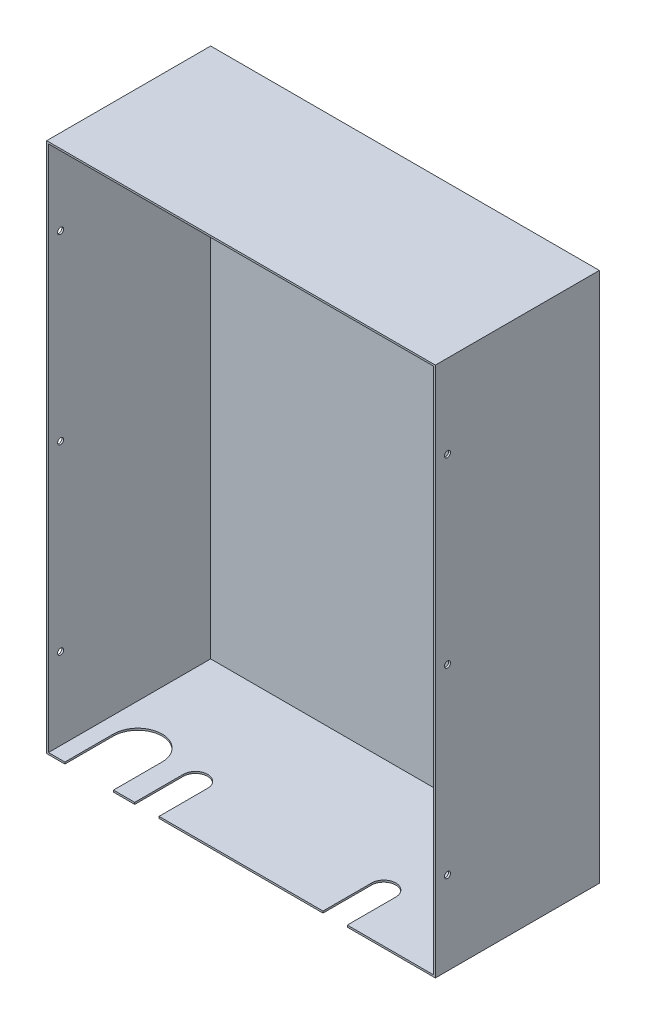
ISO-10303-21;
HEADER;
FILE_DESCRIPTION(('STEP AP214'),'2;1');
FILE_NAME('part.step','',(''),(''),'','','');
FILE_SCHEMA(('AUTOMOTIVE_DESIGN { 1 0 10303 214 1 1 1 1 }'));
ENDSEC;
DATA;
#1=APPLICATION_CONTEXT('core data for automotive mechanical design processes');
#2=APPLICATION_PROTOCOL_DEFINITION('international standard','automotive_design',2000,#1);
#3=PRODUCT_CONTEXT('',#1,'mechanical');
#4=PRODUCT('Part','Part','',(#3));
#5=PRODUCT_RELATED_PRODUCT_CATEGORY('part','',(#4));
#6=PRODUCT_DEFINITION_FORMATION('','',#4);
#7=PRODUCT_DEFINITION_CONTEXT('part definition',#1,'design');
#8=PRODUCT_DEFINITION('design','',#6,#7);
#9=PRODUCT_DEFINITION_SHAPE('','',#8);
#10=(LENGTH_UNIT() NAMED_UNIT(*) SI_UNIT(.MILLI.,.METRE.));
#11=(NAMED_UNIT(*) PLANE_ANGLE_UNIT() SI_UNIT($,.RADIAN.));
#12=(NAMED_UNIT(*) SI_UNIT($,.STERADIAN.) SOLID_ANGLE_UNIT());
#13=UNCERTAINTY_MEASURE_WITH_UNIT(LENGTH_MEASURE(1.E-05),#10,'distance_accuracy_value','');
#14=(GEOMETRIC_REPRESENTATION_CONTEXT(3) GLOBAL_UNCERTAINTY_ASSIGNED_CONTEXT((#13)) GLOBAL_UNIT_ASSIGNED_CONTEXT((#10,
#11,#12)) REPRESENTATION_CONTEXT('',''));
#15=CARTESIAN_POINT('',(0.,0.,0.));
#16=DIRECTION('',(0.,0.,1.));
#17=DIRECTION('',(1.,0.,0.));
#18=AXIS2_PLACEMENT_3D('',#15,#16,#17);
#19=CARTESIAN_POINT('',(0.,0.,135.));
#20=DIRECTION('',(0.,0.,1.));
#21=DIRECTION('',(1.,0.,0.));
#22=AXIS2_PLACEMENT_3D('',#19,#20,#21);
#23=PLANE('',#22);
#24=DIRECTION('',(0.,-1.,0.));
#25=VECTOR('',#24,1.);
#26=CARTESIAN_POINT('',(-265.,73.6110255092798,135.));
#27=LINE('',#26,#25);
#28=CARTESIAN_POINT('',(-265.,1.5,135.));
#29=VERTEX_POINT('',#28);
#30=CARTESIAN_POINT('',(-265.,0.,135.));
#31=VERTEX_POINT('',#30);
#32=EDGE_CURVE('E181',#29,#31,#27,.T.);
#33=ORIENTED_EDGE('',*,*,#32,.T.);
#34=DIRECTION('',(1.,0.,0.));
#35=VECTOR('',#34,1.);
#36=CARTESIAN_POINT('',(0.,1.22882109107973E-11,135.));
#37=LINE('',#36,#35);
#38=CARTESIAN_POINT('',(-247.5,0.,135.));
#39=VERTEX_POINT('',#38);
#40=EDGE_CURVE('E468',#31,#39,#37,.T.);
#41=ORIENTED_EDGE('',*,*,#40,.T.);
#42=DIRECTION('',(0.,-1.,0.));
#43=VECTOR('',#42,1.);
#44=CARTESIAN_POINT('',(-247.5,55.3516480713451,135.));
#45=LINE('',#44,#43);
#46=CARTESIAN_POINT('',(-247.5,1.5,135.));
#47=VERTEX_POINT('',#46);
#48=EDGE_CURVE('E206',#47,#39,#45,.T.);
#49=ORIENTED_EDGE('',*,*,#48,.F.);
#50=DIRECTION('',(1.,0.,0.));
#51=VECTOR('',#50,1.);
#52=CARTESIAN_POINT('',(0.,1.5,135.));
#53=LINE('',#52,#51);
#54=EDGE_CURVE('E198',#29,#47,#53,.T.);
#55=ORIENTED_EDGE('',*,*,#54,.F.);
#56=EDGE_LOOP('',(#33,#41,#49,#55));
#57=FACE_BOUND('',#56,.T.);
#58=ADVANCED_FACE('F41',(#57),#23,.T.);
#59=DIRECTION('',(0.,-1.,0.));
#60=VECTOR('',#59,1.);
#61=CARTESIAN_POINT('',(-227.5,55.3516480713451,135.));
#62=LINE('',#61,#60);
#63=CARTESIAN_POINT('',(-227.5,1.5,135.));
#64=VERTEX_POINT('',#63);
#65=CARTESIAN_POINT('',(-227.5,0.,135.));
#66=VERTEX_POINT('',#65);
#67=EDGE_CURVE('E271',#64,#66,#62,.T.);
#68=ORIENTED_EDGE('',*,*,#67,.T.);
#69=CARTESIAN_POINT('',(-92.5,0.,135.));
#70=VERTEX_POINT('',#69);
#71=EDGE_CURVE('E465',#66,#70,#37,.T.);
#72=ORIENTED_EDGE('',*,*,#71,.T.);
#73=DIRECTION('',(0.,-1.,0.));
#74=VECTOR('',#73,1.);
#75=CARTESIAN_POINT('',(-92.5,55.3516480713451,135.));
#76=LINE('',#75,#74);
#77=CARTESIAN_POINT('',(-92.5,1.5,135.));
#78=VERTEX_POINT('',#77);
#79=EDGE_CURVE('E245',#78,#70,#76,.T.);
#80=ORIENTED_EDGE('',*,*,#79,.F.);
#81=EDGE_CURVE('E209',#64,#78,#53,.T.);
#82=ORIENTED_EDGE('',*,*,#81,.F.);
#83=EDGE_LOOP('',(#68,#72,#80,#82));
#84=FACE_BOUND('',#83,.T.);
#85=ADVANCED_FACE('F509',(#84),#23,.T.);
#86=CARTESIAN_POINT('',(0.,437.,1.5));
#87=DIRECTION('',(0.,-1.,0.));
#88=DIRECTION('',(1.,0.,0.));
#89=AXIS2_PLACEMENT_3D('',#86,#87,#88);
#90=PLANE('',#89);
#91=DIRECTION('',(-1.,0.,0.));
#92=VECTOR('',#91,1.);
#93=CARTESIAN_POINT('',(0.,437.,0.));
#94=LINE('',#93,#92);
#95=CARTESIAN_POINT('',(0.,437.,0.));
#96=VERTEX_POINT('',#95);
#97=CARTESIAN_POINT('',(-320.,437.,0.));
#98=VERTEX_POINT('',#97);
#99=EDGE_CURVE('E380',#96,#98,#94,.T.);
#100=ORIENTED_EDGE('',*,*,#99,.T.);
#101=DIRECTION('',(0.,0.,-1.));
#102=VECTOR('',#101,1.);
#103=CARTESIAN_POINT('',(-320.,437.,1.5));
#104=LINE('',#103,#102);
#105=CARTESIAN_POINT('',(-320.,437.,135.));
#106=VERTEX_POINT('',#105);
#107=EDGE_CURVE('E11',#106,#98,#104,.T.);
#108=ORIENTED_EDGE('',*,*,#107,.F.);
#109=DIRECTION('',(-1.,0.,0.));
#110=VECTOR('',#109,1.);
#111=CARTESIAN_POINT('',(0.,437.,135.));
#112=LINE('',#111,#110);
#113=CARTESIAN_POINT('',(0.,437.,135.));
#114=VERTEX_POINT('',#113);
#115=EDGE_CURVE('E453',#114,#106,#112,.T.);
#116=ORIENTED_EDGE('',*,*,#115,.F.);
#117=DIRECTION('',(0.,0.,-1.));
#118=VECTOR('',#117,1.);
#119=CARTESIAN_POINT('',(0.,437.,1.5));
#120=LINE('',#119,#118);
#121=EDGE_CURVE('E391',#114,#96,#120,.T.);
#122=ORIENTED_EDGE('',*,*,#121,.T.);
#123=EDGE_LOOP('',(#100,#108,#116,#122));
#124=FACE_BOUND('',#123,.T.);
#125=ADVANCED_FACE('F43',(#124),#90,.F.);
#126=CARTESIAN_POINT('',(-320.,0.,1.5));
#127=DIRECTION('',(-1.,0.,0.));
#128=DIRECTION('',(0.,0.,1.));
#129=AXIS2_PLACEMENT_3D('',#126,#127,#128);
#130=PLANE('',#129);
#131=CARTESIAN_POINT('',(-320.,368.5,125.));
#132=DIRECTION('',(-1.,0.,0.));
#133=DIRECTION('',(0.,0.,1.));
#134=AXIS2_PLACEMENT_3D('',#131,#132,#133);
#135=CIRCLE('',#134,2.49999999999998);
#136=CARTESIAN_POINT('',(-320.,368.5,127.5));
#137=VERTEX_POINT('',#136);
#138=EDGE_CURVE('E347',#137,#137,#135,.T.);
#139=ORIENTED_EDGE('',*,*,#138,.F.);
#140=EDGE_LOOP('',(#139));
#141=FACE_BOUND('',#140,.T.);
#142=CARTESIAN_POINT('',(-320.,68.5,125.));
#143=DIRECTION('',(-1.,0.,0.));
#144=DIRECTION('',(0.,0.,-1.));
#145=AXIS2_PLACEMENT_3D('',#142,#143,#144);
#146=CIRCLE('',#145,2.5);
#147=CARTESIAN_POINT('',(-320.,68.5,122.5));
#148=VERTEX_POINT('',#147);
#149=EDGE_CURVE('E338',#148,#148,#146,.T.);
#150=ORIENTED_EDGE('',*,*,#149,.F.);
#151=EDGE_LOOP('',(#150));
#152=FACE_BOUND('',#151,.T.);
#153=CARTESIAN_POINT('',(-320.,218.5,125.));
#154=DIRECTION('',(-1.,0.,0.));
#155=DIRECTION('',(0.,0.,1.));
#156=AXIS2_PLACEMENT_3D('',#153,#154,#155);
#157=CIRCLE('',#156,2.49999999999998);
#158=CARTESIAN_POINT('',(-320.,218.5,127.5));
#159=VERTEX_POINT('',#158);
#160=EDGE_CURVE('E339',#159,#159,#157,.T.);
#161=ORIENTED_EDGE('',*,*,#160,.F.);
#162=EDGE_LOOP('',(#161));
#163=FACE_BOUND('',#162,.T.);
#164=DIRECTION('',(0.,1.,0.));
#165=VECTOR('',#164,1.);
#166=CARTESIAN_POINT('',(-320.,0.,0.));
#167=LINE('',#166,#165);
#168=CARTESIAN_POINT('',(-320.,0.,0.));
#169=VERTEX_POINT('',#168);
#170=EDGE_CURVE('E371',#169,#98,#167,.T.);
#171=ORIENTED_EDGE('',*,*,#170,.F.);
#172=DIRECTION('',(0.,0.,-1.));
#173=VECTOR('',#172,1.);
#174=CARTESIAN_POINT('',(-320.,0.,1.5));
#175=LINE('',#174,#173);
#176=CARTESIAN_POINT('',(-320.,0.,135.));
#177=VERTEX_POINT('',#176);
#178=EDGE_CURVE('E51',#177,#169,#175,.T.);
#179=ORIENTED_EDGE('',*,*,#178,.F.);
#180=DIRECTION('',(0.,-1.,0.));
#181=VECTOR('',#180,1.);
#182=CARTESIAN_POINT('',(-320.,0.,135.));
#183=LINE('',#182,#181);
#184=EDGE_CURVE('E466',#106,#177,#183,.T.);
#185=ORIENTED_EDGE('',*,*,#184,.F.);
#186=ORIENTED_EDGE('',*,*,#107,.T.);
#187=EDGE_LOOP('',(#171,#179,#185,#186));
#188=FACE_BOUND('',#187,.T.);
#189=ADVANCED_FACE('F361',(#141,#152,#163,#188),#130,.T.);
#190=CARTESIAN_POINT('',(0.,0.,1.5));
#191=DIRECTION('',(0.,-1.,0.));
#192=DIRECTION('',(1.,0.,0.));
#193=AXIS2_PLACEMENT_3D('',#190,#191,#192);
#194=PLANE('',#193);
#195=DIRECTION('',(0.,0.,1.));
#196=VECTOR('',#195,1.);
#197=CARTESIAN_POINT('',(-265.,0.,95.));
#198=LINE('',#197,#196);
#199=CARTESIAN_POINT('',(-265.,0.,95.));
#200=VERTEX_POINT('',#199);
#201=EDGE_CURVE('E187',#200,#31,#198,.T.);
#202=ORIENTED_EDGE('',*,*,#201,.F.);
#203=CARTESIAN_POINT('',(-285.,0.,95.));
#204=DIRECTION('',(0.,-1.,0.));
#205=DIRECTION('',(1.,0.,0.));
#206=AXIS2_PLACEMENT_3D('',#203,#204,#205);
#207=CIRCLE('',#206,20.);
#208=CARTESIAN_POINT('',(-305.,0.,95.));
#209=VERTEX_POINT('',#208);
#210=EDGE_CURVE('E311',#209,#200,#207,.T.);
#211=ORIENTED_EDGE('',*,*,#210,.F.);
#212=DIRECTION('',(0.,0.,-1.));
#213=VECTOR('',#212,1.);
#214=CARTESIAN_POINT('',(-305.,0.,95.));
#215=LINE('',#214,#213);
#216=CARTESIAN_POINT('',(-305.,0.,135.));
#217=VERTEX_POINT('',#216);
#218=EDGE_CURVE('E202',#217,#209,#215,.T.);
#219=ORIENTED_EDGE('',*,*,#218,.F.);
#220=EDGE_CURVE('E472',#177,#217,#37,.T.);
#221=ORIENTED_EDGE('',*,*,#220,.F.);
#222=ORIENTED_EDGE('',*,*,#178,.T.);
#223=DIRECTION('',(-1.,0.,0.));
#224=VECTOR('',#223,1.);
#225=CARTESIAN_POINT('',(0.,0.,0.));
#226=LINE('',#225,#224);
#227=CARTESIAN_POINT('',(0.,0.,0.));
#228=VERTEX_POINT('',#227);
#229=EDGE_CURVE('E379',#228,#169,#226,.T.);
#230=ORIENTED_EDGE('',*,*,#229,.F.);
#231=DIRECTION('',(0.,0.,-1.));
#232=VECTOR('',#231,1.);
#233=CARTESIAN_POINT('',(0.,0.,1.5));
#234=LINE('',#233,#232);
#235=CARTESIAN_POINT('',(0.,0.,135.));
#236=VERTEX_POINT('',#235);
#237=EDGE_CURVE('E398',#236,#228,#234,.T.);
#238=ORIENTED_EDGE('',*,*,#237,.F.);
#239=CARTESIAN_POINT('',(-72.5,0.,135.));
#240=VERTEX_POINT('',#239);
#241=EDGE_CURVE('E461',#240,#236,#37,.T.);
#242=ORIENTED_EDGE('',*,*,#241,.F.);
#243=DIRECTION('',(0.,0.,1.));
#244=VECTOR('',#243,1.);
#245=CARTESIAN_POINT('',(-72.5,0.,95.));
#246=LINE('',#245,#244);
#247=CARTESIAN_POINT('',(-72.5,0.,95.));
#248=VERTEX_POINT('',#247);
#249=EDGE_CURVE('E264',#248,#240,#246,.T.);
#250=ORIENTED_EDGE('',*,*,#249,.F.);
#251=CARTESIAN_POINT('',(-82.5,0.,95.));
#252=DIRECTION('',(0.,-1.,0.));
#253=DIRECTION('',(1.,0.,0.));
#254=AXIS2_PLACEMENT_3D('',#251,#252,#253);
#255=CIRCLE('',#254,10.);
#256=CARTESIAN_POINT('',(-92.5,0.,95.));
#257=VERTEX_POINT('',#256);
#258=EDGE_CURVE('E260',#257,#248,#255,.T.);
#259=ORIENTED_EDGE('',*,*,#258,.F.);
#260=DIRECTION('',(0.,0.,-1.));
#261=VECTOR('',#260,1.);
#262=CARTESIAN_POINT('',(-92.5,0.,95.));
#263=LINE('',#262,#261);
#264=EDGE_CURVE('E259',#70,#257,#263,.T.);
#265=ORIENTED_EDGE('',*,*,#264,.F.);
#266=ORIENTED_EDGE('',*,*,#71,.F.);
#267=DIRECTION('',(0.,0.,1.));
#268=VECTOR('',#267,1.);
#269=CARTESIAN_POINT('',(-227.5,0.,95.));
#270=LINE('',#269,#268);
#271=CARTESIAN_POINT('',(-227.5,0.,95.));
#272=VERTEX_POINT('',#271);
#273=EDGE_CURVE('E294',#272,#66,#270,.T.);
#274=ORIENTED_EDGE('',*,*,#273,.F.);
#275=CARTESIAN_POINT('',(-237.5,0.,95.));
#276=DIRECTION('',(0.,-1.,0.));
#277=DIRECTION('',(1.,0.,0.));
#278=AXIS2_PLACEMENT_3D('',#275,#276,#277);
#279=CIRCLE('',#278,10.);
#280=CARTESIAN_POINT('',(-247.5,0.,95.));
#281=VERTEX_POINT('',#280);
#282=EDGE_CURVE('E239',#281,#272,#279,.T.);
#283=ORIENTED_EDGE('',*,*,#282,.F.);
#284=DIRECTION('',(0.,0.,-1.));
#285=VECTOR('',#284,1.);
#286=CARTESIAN_POINT('',(-247.5,0.,95.));
#287=LINE('',#286,#285);
#288=EDGE_CURVE('E290',#39,#281,#287,.T.);
#289=ORIENTED_EDGE('',*,*,#288,.F.);
#290=ORIENTED_EDGE('',*,*,#40,.F.);
#291=EDGE_LOOP('',(#202,#211,#219,#221,#222,#230,#238,#242,#250,#259,#265,#266,#274,#283,#289,#290));
#292=FACE_BOUND('',#291,.T.);
#293=ADVANCED_FACE('F364',(#292),#194,.T.);
#294=CARTESIAN_POINT('',(0.,0.,1.5));
#295=DIRECTION('',(-1.,0.,0.));
#296=DIRECTION('',(0.,0.,1.));
#297=AXIS2_PLACEMENT_3D('',#294,#295,#296);
#298=PLANE('',#297);
#299=CARTESIAN_POINT('',(0.,368.5,125.));
#300=DIRECTION('',(-1.,0.,0.));
#301=DIRECTION('',(0.,0.,1.));
#302=AXIS2_PLACEMENT_3D('',#299,#300,#301);
#303=CIRCLE('',#302,2.49999999999998);
#304=CARTESIAN_POINT('',(0.,368.5,127.5));
#305=VERTEX_POINT('',#304);
#306=EDGE_CURVE('E351',#305,#305,#303,.F.);
#307=ORIENTED_EDGE('',*,*,#306,.F.);
#308=EDGE_LOOP('',(#307));
#309=FACE_BOUND('',#308,.T.);
#310=CARTESIAN_POINT('',(0.,68.5,125.));
#311=DIRECTION('',(-1.,0.,0.));
#312=DIRECTION('',(0.,0.,1.));
#313=AXIS2_PLACEMENT_3D('',#310,#311,#312);
#314=CIRCLE('',#313,2.5);
#315=CARTESIAN_POINT('',(0.,68.5,127.5));
#316=VERTEX_POINT('',#315);
#317=EDGE_CURVE('E343',#316,#316,#314,.F.);
#318=ORIENTED_EDGE('',*,*,#317,.F.);
#319=EDGE_LOOP('',(#318));
#320=FACE_BOUND('',#319,.T.);
#321=CARTESIAN_POINT('',(0.,218.5,125.));
#322=DIRECTION('',(-1.,0.,0.));
#323=DIRECTION('',(0.,0.,1.));
#324=AXIS2_PLACEMENT_3D('',#321,#322,#323);
#325=CIRCLE('',#324,2.49999999999998);
#326=CARTESIAN_POINT('',(0.,218.5,127.5));
#327=VERTEX_POINT('',#326);
#328=EDGE_CURVE('E334',#327,#327,#325,.F.);
#329=ORIENTED_EDGE('',*,*,#328,.F.);
#330=EDGE_LOOP('',(#329));
#331=FACE_BOUND('',#330,.T.);
#332=DIRECTION('',(0.,1.,0.));
#333=VECTOR('',#332,1.);
#334=CARTESIAN_POINT('',(0.,0.,0.));
#335=LINE('',#334,#333);
#336=EDGE_CURVE('E385',#228,#96,#335,.T.);
#337=ORIENTED_EDGE('',*,*,#336,.T.);
#338=ORIENTED_EDGE('',*,*,#121,.F.);
#339=DIRECTION('',(0.,1.,0.));
#340=VECTOR('',#339,1.);
#341=CARTESIAN_POINT('',(0.,0.,135.));
#342=LINE('',#341,#340);
#343=EDGE_CURVE('E458',#236,#114,#342,.T.);
#344=ORIENTED_EDGE('',*,*,#343,.F.);
#345=ORIENTED_EDGE('',*,*,#237,.T.);
#346=EDGE_LOOP('',(#337,#338,#344,#345));
#347=FACE_BOUND('',#346,.T.);
#348=ADVANCED_FACE('F457',(#309,#320,#331,#347),#298,.F.);
#349=CARTESIAN_POINT('',(0.,0.,0.));
#350=DIRECTION('',(0.,0.,-1.));
#351=DIRECTION('',(-1.,0.,0.));
#352=AXIS2_PLACEMENT_3D('',#349,#350,#351);
#353=PLANE('',#352);
#354=ORIENTED_EDGE('',*,*,#99,.F.);
#355=ORIENTED_EDGE('',*,*,#336,.F.);
#356=ORIENTED_EDGE('',*,*,#229,.T.);
#357=ORIENTED_EDGE('',*,*,#170,.T.);
#358=EDGE_LOOP('',(#354,#355,#356,#357));
#359=FACE_BOUND('',#358,.T.);
#360=ADVANCED_FACE('F384',(#359),#353,.T.);
#361=CARTESIAN_POINT('',(-1.5,0.,135.));
#362=DIRECTION('',(-1.,0.,0.));
#363=DIRECTION('',(0.,-1.,0.));
#364=AXIS2_PLACEMENT_3D('',#361,#362,#363);
#365=PLANE('',#364);
#366=CARTESIAN_POINT('',(-1.5,368.5,125.));
#367=DIRECTION('',(-1.,0.,0.));
#368=DIRECTION('',(0.,-1.,0.));
#369=AXIS2_PLACEMENT_3D('',#366,#367,#368);
#370=CIRCLE('',#369,2.49999999999998);
#371=CARTESIAN_POINT('',(-1.5,366.,125.));
#372=VERTEX_POINT('',#371);
#373=EDGE_CURVE('E315',#372,#372,#370,.T.);
#374=ORIENTED_EDGE('',*,*,#373,.F.);
#375=EDGE_LOOP('',(#374));
#376=FACE_BOUND('',#375,.T.);
#377=CARTESIAN_POINT('',(-1.5,68.5,125.));
#378=DIRECTION('',(-1.,0.,0.));
#379=DIRECTION('',(0.,-1.,0.));
#380=AXIS2_PLACEMENT_3D('',#377,#378,#379);
#381=CIRCLE('',#380,2.5);
#382=CARTESIAN_POINT('',(-1.5,66.,125.));
#383=VERTEX_POINT('',#382);
#384=EDGE_CURVE('E324',#383,#383,#381,.T.);
#385=ORIENTED_EDGE('',*,*,#384,.F.);
#386=EDGE_LOOP('',(#385));
#387=FACE_BOUND('',#386,.T.);
#388=CARTESIAN_POINT('',(-1.5,218.5,125.));
#389=DIRECTION('',(-1.,0.,0.));
#390=DIRECTION('',(0.,-1.,0.));
#391=AXIS2_PLACEMENT_3D('',#388,#389,#390);
#392=CIRCLE('',#391,2.49999999999998);
#393=CARTESIAN_POINT('',(-1.5,216.,125.));
#394=VERTEX_POINT('',#393);
#395=EDGE_CURVE('E329',#394,#394,#392,.T.);
#396=ORIENTED_EDGE('',*,*,#395,.F.);
#397=EDGE_LOOP('',(#396));
#398=FACE_BOUND('',#397,.T.);
#399=DIRECTION('',(0.,1.,0.));
#400=VECTOR('',#399,1.);
#401=CARTESIAN_POINT('',(-1.5,0.,1.5));
#402=LINE('',#401,#400);
#403=CARTESIAN_POINT('',(-1.5,1.5,1.5));
#404=VERTEX_POINT('',#403);
#405=CARTESIAN_POINT('',(-1.5,435.5,1.5));
#406=VERTEX_POINT('',#405);
#407=EDGE_CURVE('E437',#404,#406,#402,.T.);
#408=ORIENTED_EDGE('',*,*,#407,.F.);
#409=DIRECTION('',(0.,0.,-1.));
#410=VECTOR('',#409,1.);
#411=CARTESIAN_POINT('',(-1.5,1.5,135.));
#412=LINE('',#411,#410);
#413=CARTESIAN_POINT('',(-1.5,1.5,135.));
#414=VERTEX_POINT('',#413);
#415=EDGE_CURVE('E440',#414,#404,#412,.T.);
#416=ORIENTED_EDGE('',*,*,#415,.F.);
#417=DIRECTION('',(0.,1.,0.));
#418=VECTOR('',#417,1.);
#419=CARTESIAN_POINT('',(-1.5,0.,135.));
#420=LINE('',#419,#418);
#421=CARTESIAN_POINT('',(-1.5,435.5,135.));
#422=VERTEX_POINT('',#421);
#423=EDGE_CURVE('E220',#414,#422,#420,.T.);
#424=ORIENTED_EDGE('',*,*,#423,.T.);
#425=DIRECTION('',(0.,0.,-1.));
#426=VECTOR('',#425,1.);
#427=CARTESIAN_POINT('',(-1.5,435.5,135.));
#428=LINE('',#427,#426);
#429=EDGE_CURVE('E478',#422,#406,#428,.T.);
#430=ORIENTED_EDGE('',*,*,#429,.T.);
#431=EDGE_LOOP('',(#408,#416,#424,#430));
#432=FACE_BOUND('',#431,.T.);
#433=ADVANCED_FACE('F498',(#376,#387,#398,#432),#365,.T.);
#434=CARTESIAN_POINT('',(0.,1.5,135.));
#435=DIRECTION('',(0.,1.,0.));
#436=DIRECTION('',(0.,0.,1.));
#437=AXIS2_PLACEMENT_3D('',#434,#435,#436);
#438=PLANE('',#437);
#439=DIRECTION('',(0.,0.,1.));
#440=VECTOR('',#439,1.);
#441=CARTESIAN_POINT('',(-265.,1.5,95.));
#442=LINE('',#441,#440);
#443=CARTESIAN_POINT('',(-265.,1.5,95.));
#444=VERTEX_POINT('',#443);
#445=EDGE_CURVE('E184',#444,#29,#442,.T.);
#446=ORIENTED_EDGE('',*,*,#445,.T.);
#447=ORIENTED_EDGE('',*,*,#54,.T.);
#448=DIRECTION('',(0.,0.,-1.));
#449=VECTOR('',#448,1.);
#450=CARTESIAN_POINT('',(-247.5,1.5,95.));
#451=LINE('',#450,#449);
#452=CARTESIAN_POINT('',(-247.5,1.5,95.));
#453=VERTEX_POINT('',#452);
#454=EDGE_CURVE('E278',#47,#453,#451,.T.);
#455=ORIENTED_EDGE('',*,*,#454,.T.);
#456=CARTESIAN_POINT('',(-237.5,1.5,95.));
#457=DIRECTION('',(0.,1.,0.));
#458=DIRECTION('',(0.,0.,1.));
#459=AXIS2_PLACEMENT_3D('',#456,#457,#458);
#460=CIRCLE('',#459,10.);
#461=CARTESIAN_POINT('',(-227.5,1.5,95.));
#462=VERTEX_POINT('',#461);
#463=EDGE_CURVE('E233',#453,#462,#460,.F.);
#464=ORIENTED_EDGE('',*,*,#463,.T.);
#465=DIRECTION('',(0.,0.,1.));
#466=VECTOR('',#465,1.);
#467=CARTESIAN_POINT('',(-227.5,1.5,95.));
#468=LINE('',#467,#466);
#469=EDGE_CURVE('E275',#462,#64,#468,.T.);
#470=ORIENTED_EDGE('',*,*,#469,.T.);
#471=ORIENTED_EDGE('',*,*,#81,.T.);
#472=DIRECTION('',(0.,0.,-1.));
#473=VECTOR('',#472,1.);
#474=CARTESIAN_POINT('',(-92.5,1.5,95.));
#475=LINE('',#474,#473);
#476=CARTESIAN_POINT('',(-92.5,1.5,95.));
#477=VERTEX_POINT('',#476);
#478=EDGE_CURVE('E67',#78,#477,#475,.T.);
#479=ORIENTED_EDGE('',*,*,#478,.T.);
#480=CARTESIAN_POINT('',(-82.5,1.5,95.));
#481=DIRECTION('',(0.,1.,0.));
#482=DIRECTION('',(0.,0.,1.));
#483=AXIS2_PLACEMENT_3D('',#480,#481,#482);
#484=CIRCLE('',#483,10.);
#485=CARTESIAN_POINT('',(-72.5,1.5,95.));
#486=VERTEX_POINT('',#485);
#487=EDGE_CURVE('E240',#477,#486,#484,.F.);
#488=ORIENTED_EDGE('',*,*,#487,.T.);
#489=DIRECTION('',(0.,0.,1.));
#490=VECTOR('',#489,1.);
#491=CARTESIAN_POINT('',(-72.5,1.5,95.));
#492=LINE('',#491,#490);
#493=CARTESIAN_POINT('',(-72.5,1.5,135.));
#494=VERTEX_POINT('',#493);
#495=EDGE_CURVE('E246',#486,#494,#492,.T.);
#496=ORIENTED_EDGE('',*,*,#495,.T.);
#497=EDGE_CURVE('E211',#494,#414,#53,.T.);
#498=ORIENTED_EDGE('',*,*,#497,.T.);
#499=ORIENTED_EDGE('',*,*,#415,.T.);
#500=DIRECTION('',(1.,0.,0.));
#501=VECTOR('',#500,1.);
#502=CARTESIAN_POINT('',(0.,1.5,1.5));
#503=LINE('',#502,#501);
#504=CARTESIAN_POINT('',(-318.5,1.5,1.5));
#505=VERTEX_POINT('',#504);
#506=EDGE_CURVE('E432',#505,#404,#503,.T.);
#507=ORIENTED_EDGE('',*,*,#506,.F.);
#508=DIRECTION('',(0.,0.,-1.));
#509=VECTOR('',#508,1.);
#510=CARTESIAN_POINT('',(-318.5,1.5,135.));
#511=LINE('',#510,#509);
#512=CARTESIAN_POINT('',(-318.5,1.5,135.));
#513=VERTEX_POINT('',#512);
#514=EDGE_CURVE('E428',#513,#505,#511,.T.);
#515=ORIENTED_EDGE('',*,*,#514,.F.);
#516=CARTESIAN_POINT('',(-305.,1.5,135.));
#517=VERTEX_POINT('',#516);
#518=EDGE_CURVE('E208',#513,#517,#53,.T.);
#519=ORIENTED_EDGE('',*,*,#518,.T.);
#520=DIRECTION('',(0.,0.,-1.));
#521=VECTOR('',#520,1.);
#522=CARTESIAN_POINT('',(-305.,1.5,95.));
#523=LINE('',#522,#521);
#524=CARTESIAN_POINT('',(-305.,1.5,95.));
#525=VERTEX_POINT('',#524);
#526=EDGE_CURVE('E59',#517,#525,#523,.T.);
#527=ORIENTED_EDGE('',*,*,#526,.T.);
#528=CARTESIAN_POINT('',(-285.,1.5,95.));
#529=DIRECTION('',(0.,1.,0.));
#530=DIRECTION('',(0.,0.,1.));
#531=AXIS2_PLACEMENT_3D('',#528,#529,#530);
#532=CIRCLE('',#531,20.);
#533=EDGE_CURVE('E200',#525,#444,#532,.F.);
#534=ORIENTED_EDGE('',*,*,#533,.T.);
#535=EDGE_LOOP('',(#446,#447,#455,#464,#470,#471,#479,#488,#496,#498,#499,#507,#515,#519,#527,#534));
#536=FACE_BOUND('',#535,.T.);
#537=ADVANCED_FACE('F196',(#536),#438,.T.);
#538=CARTESIAN_POINT('',(-318.5,0.,135.));
#539=DIRECTION('',(1.,0.,0.));
#540=DIRECTION('',(0.,1.,0.));
#541=AXIS2_PLACEMENT_3D('',#538,#539,#540);
#542=PLANE('',#541);
#543=CARTESIAN_POINT('',(-318.5,368.5,125.));
#544=DIRECTION('',(1.,0.,0.));
#545=DIRECTION('',(0.,1.,0.));
#546=AXIS2_PLACEMENT_3D('',#543,#544,#545);
#547=CIRCLE('',#546,2.49999999999998);
#548=CARTESIAN_POINT('',(-318.5,371.,125.));
#549=VERTEX_POINT('',#548);
#550=EDGE_CURVE('E45',#549,#549,#547,.T.);
#551=ORIENTED_EDGE('',*,*,#550,.F.);
#552=EDGE_LOOP('',(#551));
#553=FACE_BOUND('',#552,.T.);
#554=CARTESIAN_POINT('',(-318.5,68.5,125.));
#555=DIRECTION('',(1.,0.,0.));
#556=DIRECTION('',(0.,1.,0.));
#557=AXIS2_PLACEMENT_3D('',#554,#555,#556);
#558=CIRCLE('',#557,2.5);
#559=CARTESIAN_POINT('',(-318.5,71.,125.));
#560=VERTEX_POINT('',#559);
#561=EDGE_CURVE('E328',#560,#560,#558,.T.);
#562=ORIENTED_EDGE('',*,*,#561,.F.);
#563=EDGE_LOOP('',(#562));
#564=FACE_BOUND('',#563,.T.);
#565=CARTESIAN_POINT('',(-318.5,218.5,125.));
#566=DIRECTION('',(1.,0.,0.));
#567=DIRECTION('',(0.,1.,0.));
#568=AXIS2_PLACEMENT_3D('',#565,#566,#567);
#569=CIRCLE('',#568,2.49999999999998);
#570=CARTESIAN_POINT('',(-318.5,221.,125.));
#571=VERTEX_POINT('',#570);
#572=EDGE_CURVE('E333',#571,#571,#569,.T.);
#573=ORIENTED_EDGE('',*,*,#572,.F.);
#574=EDGE_LOOP('',(#573));
#575=FACE_BOUND('',#574,.T.);
#576=DIRECTION('',(0.,-1.,0.));
#577=VECTOR('',#576,1.);
#578=CARTESIAN_POINT('',(-318.5,0.,1.5));
#579=LINE('',#578,#577);
#580=CARTESIAN_POINT('',(-318.5,435.5,1.5));
#581=VERTEX_POINT('',#580);
#582=EDGE_CURVE('E423',#581,#505,#579,.T.);
#583=ORIENTED_EDGE('',*,*,#582,.F.);
#584=DIRECTION('',(0.,0.,-1.));
#585=VECTOR('',#584,1.);
#586=CARTESIAN_POINT('',(-318.5,435.5,135.));
#587=LINE('',#586,#585);
#588=CARTESIAN_POINT('',(-318.5,435.5,135.));
#589=VERTEX_POINT('',#588);
#590=EDGE_CURVE('E426',#589,#581,#587,.T.);
#591=ORIENTED_EDGE('',*,*,#590,.F.);
#592=DIRECTION('',(0.,-1.,0.));
#593=VECTOR('',#592,1.);
#594=CARTESIAN_POINT('',(-318.5,0.,135.));
#595=LINE('',#594,#593);
#596=EDGE_CURVE('E215',#589,#513,#595,.T.);
#597=ORIENTED_EDGE('',*,*,#596,.T.);
#598=ORIENTED_EDGE('',*,*,#514,.T.);
#599=EDGE_LOOP('',(#583,#591,#597,#598));
#600=FACE_BOUND('',#599,.T.);
#601=ADVANCED_FACE('F412',(#553,#564,#575,#600),#542,.T.);
#602=CARTESIAN_POINT('',(0.,435.5,135.));
#603=DIRECTION('',(0.,-1.,0.));
#604=DIRECTION('',(1.,0.,0.));
#605=AXIS2_PLACEMENT_3D('',#602,#603,#604);
#606=PLANE('',#605);
#607=DIRECTION('',(-1.,0.,0.));
#608=VECTOR('',#607,1.);
#609=CARTESIAN_POINT('',(0.,435.5,1.5));
#610=LINE('',#609,#608);
#611=EDGE_CURVE('E433',#406,#581,#610,.T.);
#612=ORIENTED_EDGE('',*,*,#611,.F.);
#613=ORIENTED_EDGE('',*,*,#429,.F.);
#614=DIRECTION('',(-1.,0.,0.));
#615=VECTOR('',#614,1.);
#616=CARTESIAN_POINT('',(0.,435.5,135.));
#617=LINE('',#616,#615);
#618=EDGE_CURVE('E485',#422,#589,#617,.T.);
#619=ORIENTED_EDGE('',*,*,#618,.T.);
#620=ORIENTED_EDGE('',*,*,#590,.T.);
#621=EDGE_LOOP('',(#612,#613,#619,#620));
#622=FACE_BOUND('',#621,.T.);
#623=ADVANCED_FACE('F415',(#622),#606,.T.);
#624=DIRECTION('',(0.,-1.,0.));
#625=VECTOR('',#624,1.);
#626=CARTESIAN_POINT('',(-305.,73.6110255092798,135.));
#627=LINE('',#626,#625);
#628=EDGE_CURVE('E192',#517,#217,#627,.T.);
#629=ORIENTED_EDGE('',*,*,#628,.F.);
#630=ORIENTED_EDGE('',*,*,#518,.F.);
#631=ORIENTED_EDGE('',*,*,#596,.F.);
#632=ORIENTED_EDGE('',*,*,#618,.F.);
#633=ORIENTED_EDGE('',*,*,#423,.F.);
#634=ORIENTED_EDGE('',*,*,#497,.F.);
#635=DIRECTION('',(0.,-1.,0.));
#636=VECTOR('',#635,1.);
#637=CARTESIAN_POINT('',(-72.5,55.3516480713451,135.));
#638=LINE('',#637,#636);
#639=EDGE_CURVE('E241',#494,#240,#638,.T.);
#640=ORIENTED_EDGE('',*,*,#639,.T.);
#641=ORIENTED_EDGE('',*,*,#241,.T.);
#642=ORIENTED_EDGE('',*,*,#343,.T.);
#643=ORIENTED_EDGE('',*,*,#115,.T.);
#644=ORIENTED_EDGE('',*,*,#184,.T.);
#645=ORIENTED_EDGE('',*,*,#220,.T.);
#646=EDGE_LOOP('',(#629,#630,#631,#632,#633,#634,#640,#641,#642,#643,#644,#645));
#647=FACE_BOUND('',#646,.T.);
#648=ADVANCED_FACE('F493',(#647),#23,.T.);
#649=CARTESIAN_POINT('',(0.,0.,1.5));
#650=DIRECTION('',(0.,0.,-1.));
#651=DIRECTION('',(-1.,0.,0.));
#652=AXIS2_PLACEMENT_3D('',#649,#650,#651);
#653=PLANE('',#652);
#654=ORIENTED_EDGE('',*,*,#506,.T.);
#655=ORIENTED_EDGE('',*,*,#407,.T.);
#656=ORIENTED_EDGE('',*,*,#611,.T.);
#657=ORIENTED_EDGE('',*,*,#582,.T.);
#658=EDGE_LOOP('',(#654,#655,#656,#657));
#659=FACE_BOUND('',#658,.T.);
#660=ADVANCED_FACE('F436',(#659),#653,.F.);
#661=CARTESIAN_POINT('',(-72.5,55.3516480713451,95.));
#662=DIRECTION('',(1.,0.,0.));
#663=DIRECTION('',(0.,0.,-1.));
#664=AXIS2_PLACEMENT_3D('',#661,#662,#663);
#665=PLANE('',#664);
#666=DIRECTION('',(0.,-1.,0.));
#667=VECTOR('',#666,1.);
#668=CARTESIAN_POINT('',(-72.5,55.3516480713451,95.));
#669=LINE('',#668,#667);
#670=EDGE_CURVE('E236',#486,#248,#669,.T.);
#671=ORIENTED_EDGE('',*,*,#670,.T.);
#672=ORIENTED_EDGE('',*,*,#249,.T.);
#673=ORIENTED_EDGE('',*,*,#639,.F.);
#674=ORIENTED_EDGE('',*,*,#495,.F.);
#675=EDGE_LOOP('',(#671,#672,#673,#674));
#676=FACE_BOUND('',#675,.T.);
#677=ADVANCED_FACE('F500',(#676),#665,.F.);
#678=CARTESIAN_POINT('',(-92.5,55.3516480713451,95.));
#679=DIRECTION('',(-1.,0.,0.));
#680=DIRECTION('',(0.,-1.,0.));
#681=AXIS2_PLACEMENT_3D('',#678,#679,#680);
#682=PLANE('',#681);
#683=ORIENTED_EDGE('',*,*,#79,.T.);
#684=ORIENTED_EDGE('',*,*,#264,.T.);
#685=DIRECTION('',(0.,-1.,0.));
#686=VECTOR('',#685,1.);
#687=CARTESIAN_POINT('',(-92.5,55.3516480713451,95.));
#688=LINE('',#687,#686);
#689=EDGE_CURVE('E249',#477,#257,#688,.T.);
#690=ORIENTED_EDGE('',*,*,#689,.F.);
#691=ORIENTED_EDGE('',*,*,#478,.F.);
#692=EDGE_LOOP('',(#683,#684,#690,#691));
#693=FACE_BOUND('',#692,.T.);
#694=ADVANCED_FACE('F504',(#693),#682,.F.);
#695=CARTESIAN_POINT('',(-82.5,55.3516480713451,95.));
#696=DIRECTION('',(0.,-1.,0.));
#697=DIRECTION('',(1.,0.,0.));
#698=AXIS2_PLACEMENT_3D('',#695,#696,#697);
#699=CYLINDRICAL_SURFACE('',#698,10.);
#700=ORIENTED_EDGE('',*,*,#689,.T.);
#701=ORIENTED_EDGE('',*,*,#258,.T.);
#702=ORIENTED_EDGE('',*,*,#670,.F.);
#703=ORIENTED_EDGE('',*,*,#487,.F.);
#704=EDGE_LOOP('',(#700,#701,#702,#703));
#705=FACE_BOUND('',#704,.T.);
#706=ADVANCED_FACE('F503',(#705),#699,.F.);
#707=CARTESIAN_POINT('',(-227.5,55.3516480713451,95.));
#708=DIRECTION('',(1.,0.,0.));
#709=DIRECTION('',(0.,0.,-1.));
#710=AXIS2_PLACEMENT_3D('',#707,#708,#709);
#711=PLANE('',#710);
#712=DIRECTION('',(0.,-1.,0.));
#713=VECTOR('',#712,1.);
#714=CARTESIAN_POINT('',(-227.5,55.3516480713451,95.));
#715=LINE('',#714,#713);
#716=EDGE_CURVE('E227',#462,#272,#715,.T.);
#717=ORIENTED_EDGE('',*,*,#716,.T.);
#718=ORIENTED_EDGE('',*,*,#273,.T.);
#719=ORIENTED_EDGE('',*,*,#67,.F.);
#720=ORIENTED_EDGE('',*,*,#469,.F.);
#721=EDGE_LOOP('',(#717,#718,#719,#720));
#722=FACE_BOUND('',#721,.T.);
#723=ADVANCED_FACE('F512',(#722),#711,.F.);
#724=CARTESIAN_POINT('',(-247.5,55.3516480713451,95.));
#725=DIRECTION('',(-1.,0.,0.));
#726=DIRECTION('',(0.,-1.,0.));
#727=AXIS2_PLACEMENT_3D('',#724,#725,#726);
#728=PLANE('',#727);
#729=ORIENTED_EDGE('',*,*,#48,.T.);
#730=ORIENTED_EDGE('',*,*,#288,.T.);
#731=DIRECTION('',(0.,-1.,0.));
#732=VECTOR('',#731,1.);
#733=CARTESIAN_POINT('',(-247.5,55.3516480713451,95.));
#734=LINE('',#733,#732);
#735=EDGE_CURVE('E279',#453,#281,#734,.T.);
#736=ORIENTED_EDGE('',*,*,#735,.F.);
#737=ORIENTED_EDGE('',*,*,#454,.F.);
#738=EDGE_LOOP('',(#729,#730,#736,#737));
#739=FACE_BOUND('',#738,.T.);
#740=ADVANCED_FACE('F518',(#739),#728,.F.);
#741=CARTESIAN_POINT('',(-237.5,55.3516480713451,95.));
#742=DIRECTION('',(0.,-1.,0.));
#743=DIRECTION('',(1.,0.,0.));
#744=AXIS2_PLACEMENT_3D('',#741,#742,#743);
#745=CYLINDRICAL_SURFACE('',#744,10.);
#746=ORIENTED_EDGE('',*,*,#735,.T.);
#747=ORIENTED_EDGE('',*,*,#282,.T.);
#748=ORIENTED_EDGE('',*,*,#716,.F.);
#749=ORIENTED_EDGE('',*,*,#463,.F.);
#750=EDGE_LOOP('',(#746,#747,#748,#749));
#751=FACE_BOUND('',#750,.T.);
#752=ADVANCED_FACE('F516',(#751),#745,.F.);
#753=CARTESIAN_POINT('',(-265.,73.6110255092798,95.));
#754=DIRECTION('',(1.,0.,0.));
#755=DIRECTION('',(0.,1.,0.));
#756=AXIS2_PLACEMENT_3D('',#753,#754,#755);
#757=PLANE('',#756);
#758=DIRECTION('',(0.,-1.,0.));
#759=VECTOR('',#758,1.);
#760=CARTESIAN_POINT('',(-265.,73.6110255092798,95.));
#761=LINE('',#760,#759);
#762=EDGE_CURVE('E265',#444,#200,#761,.T.);
#763=ORIENTED_EDGE('',*,*,#762,.T.);
#764=ORIENTED_EDGE('',*,*,#201,.T.);
#765=ORIENTED_EDGE('',*,*,#32,.F.);
#766=ORIENTED_EDGE('',*,*,#445,.F.);
#767=EDGE_LOOP('',(#763,#764,#765,#766));
#768=FACE_BOUND('',#767,.T.);
#769=ADVANCED_FACE('F183',(#768),#757,.F.);
#770=CARTESIAN_POINT('',(-305.,73.6110255092798,95.));
#771=DIRECTION('',(-1.,0.,0.));
#772=DIRECTION('',(0.,-1.,0.));
#773=AXIS2_PLACEMENT_3D('',#770,#771,#772);
#774=PLANE('',#773);
#775=ORIENTED_EDGE('',*,*,#628,.T.);
#776=ORIENTED_EDGE('',*,*,#218,.T.);
#777=DIRECTION('',(0.,-1.,0.));
#778=VECTOR('',#777,1.);
#779=CARTESIAN_POINT('',(-305.,73.6110255092798,95.));
#780=LINE('',#779,#778);
#781=EDGE_CURVE('E304',#525,#209,#780,.T.);
#782=ORIENTED_EDGE('',*,*,#781,.F.);
#783=ORIENTED_EDGE('',*,*,#526,.F.);
#784=EDGE_LOOP('',(#775,#776,#782,#783));
#785=FACE_BOUND('',#784,.T.);
#786=ADVANCED_FACE('F496',(#785),#774,.F.);
#787=CARTESIAN_POINT('',(-285.,73.6110255092798,95.));
#788=DIRECTION('',(0.,-1.,0.));
#789=DIRECTION('',(1.,0.,0.));
#790=AXIS2_PLACEMENT_3D('',#787,#788,#789);
#791=CYLINDRICAL_SURFACE('',#790,20.);
#792=ORIENTED_EDGE('',*,*,#781,.T.);
#793=ORIENTED_EDGE('',*,*,#210,.T.);
#794=ORIENTED_EDGE('',*,*,#762,.F.);
#795=ORIENTED_EDGE('',*,*,#533,.F.);
#796=EDGE_LOOP('',(#792,#793,#794,#795));
#797=FACE_BOUND('',#796,.T.);
#798=ADVANCED_FACE('F593',(#797),#791,.F.);
#799=CARTESIAN_POINT('',(7.07106781186551,218.5,125.));
#800=DIRECTION('',(-1.,0.,0.));
#801=DIRECTION('',(0.,0.,1.));
#802=AXIS2_PLACEMENT_3D('',#799,#800,#801);
#803=CYLINDRICAL_SURFACE('',#802,2.49999999999998);
#804=ORIENTED_EDGE('',*,*,#572,.T.);
#805=EDGE_LOOP('',(#804));
#806=FACE_BOUND('',#805,.T.);
#807=ORIENTED_EDGE('',*,*,#160,.T.);
#808=EDGE_LOOP('',(#807));
#809=FACE_BOUND('',#808,.T.);
#810=ADVANCED_FACE('F588',(#806,#809),#803,.F.);
#811=CARTESIAN_POINT('',(7.07106781186551,68.5,125.));
#812=DIRECTION('',(-1.,0.,0.));
#813=DIRECTION('',(0.,0.,1.));
#814=AXIS2_PLACEMENT_3D('',#811,#812,#813);
#815=CYLINDRICAL_SURFACE('',#814,2.5);
#816=ORIENTED_EDGE('',*,*,#561,.T.);
#817=EDGE_LOOP('',(#816));
#818=FACE_BOUND('',#817,.T.);
#819=ORIENTED_EDGE('',*,*,#149,.T.);
#820=EDGE_LOOP('',(#819));
#821=FACE_BOUND('',#820,.T.);
#822=ADVANCED_FACE('F409',(#818,#821),#815,.F.);
#823=CARTESIAN_POINT('',(7.07106781186551,368.5,125.));
#824=DIRECTION('',(-1.,0.,0.));
#825=DIRECTION('',(0.,0.,1.));
#826=AXIS2_PLACEMENT_3D('',#823,#824,#825);
#827=CYLINDRICAL_SURFACE('',#826,2.49999999999998);
#828=ORIENTED_EDGE('',*,*,#550,.T.);
#829=EDGE_LOOP('',(#828));
#830=FACE_BOUND('',#829,.T.);
#831=ORIENTED_EDGE('',*,*,#138,.T.);
#832=EDGE_LOOP('',(#831));
#833=FACE_BOUND('',#832,.T.);
#834=ADVANCED_FACE('F359',(#830,#833),#827,.F.);
#835=ORIENTED_EDGE('',*,*,#395,.T.);
#836=EDGE_LOOP('',(#835));
#837=FACE_BOUND('',#836,.T.);
#838=ORIENTED_EDGE('',*,*,#328,.T.);
#839=EDGE_LOOP('',(#838));
#840=FACE_BOUND('',#839,.T.);
#841=ADVANCED_FACE('F596',(#837,#840),#803,.F.);
#842=ORIENTED_EDGE('',*,*,#384,.T.);
#843=EDGE_LOOP('',(#842));
#844=FACE_BOUND('',#843,.T.);
#845=ORIENTED_EDGE('',*,*,#317,.T.);
#846=EDGE_LOOP('',(#845));
#847=FACE_BOUND('',#846,.T.);
#848=ADVANCED_FACE('F607',(#844,#847),#815,.F.);
#849=ORIENTED_EDGE('',*,*,#373,.T.);
#850=EDGE_LOOP('',(#849));
#851=FACE_BOUND('',#850,.T.);
#852=ORIENTED_EDGE('',*,*,#306,.T.);
#853=EDGE_LOOP('',(#852));
#854=FACE_BOUND('',#853,.T.);
#855=ADVANCED_FACE('F617',(#851,#854),#827,.F.);
#856=CLOSED_SHELL('',(#58,#85,#125,#189,#293,#348,#360,#433,#537,#601,#623,#648,#660,#677,#694,
#706,#723,#740,#752,#769,#786,#798,#810,#822,#834,#841,#848,#855));
#857=MANIFOLD_SOLID_BREP('B2',#856);
#858=ADVANCED_BREP_SHAPE_REPRESENTATION('',(#18,#857),#14);
#859=SHAPE_DEFINITION_REPRESENTATION(#9,#858);
ENDSEC;
END-ISO-10303-21;
